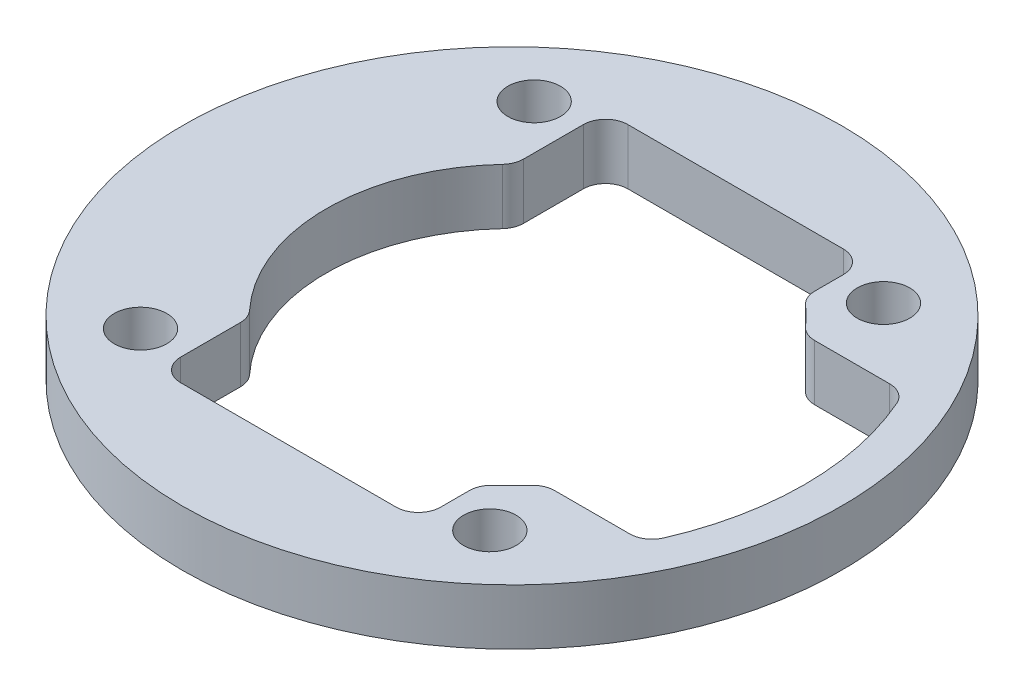
ISO-10303-21;
HEADER;
FILE_DESCRIPTION(('STEP AP214'),'2;1');
FILE_NAME('part.step','',(''),(''),'','','');
FILE_SCHEMA(('AUTOMOTIVE_DESIGN { 1 0 10303 214 1 1 1 1 }'));
ENDSEC;
DATA;
#1=APPLICATION_CONTEXT('core data for automotive mechanical design processes');
#2=APPLICATION_PROTOCOL_DEFINITION('international standard','automotive_design',2000,#1);
#3=PRODUCT_CONTEXT('',#1,'mechanical');
#4=PRODUCT('Part','Part','',(#3));
#5=PRODUCT_RELATED_PRODUCT_CATEGORY('part','',(#4));
#6=PRODUCT_DEFINITION_FORMATION('','',#4);
#7=PRODUCT_DEFINITION_CONTEXT('part definition',#1,'design');
#8=PRODUCT_DEFINITION('design','',#6,#7);
#9=PRODUCT_DEFINITION_SHAPE('','',#8);
#10=(LENGTH_UNIT() NAMED_UNIT(*) SI_UNIT(.MILLI.,.METRE.));
#11=(NAMED_UNIT(*) PLANE_ANGLE_UNIT() SI_UNIT($,.RADIAN.));
#12=(NAMED_UNIT(*) SI_UNIT($,.STERADIAN.) SOLID_ANGLE_UNIT());
#13=UNCERTAINTY_MEASURE_WITH_UNIT(LENGTH_MEASURE(1.E-05),#10,'distance_accuracy_value','');
#14=(GEOMETRIC_REPRESENTATION_CONTEXT(3) GLOBAL_UNCERTAINTY_ASSIGNED_CONTEXT((#13)) GLOBAL_UNIT_ASSIGNED_CONTEXT((#10,
#11,#12)) REPRESENTATION_CONTEXT('',''));
#15=CARTESIAN_POINT('',(0.,0.,0.));
#16=DIRECTION('',(0.,0.,1.));
#17=DIRECTION('',(1.,0.,0.));
#18=AXIS2_PLACEMENT_3D('',#15,#16,#17);
#19=CARTESIAN_POINT('',(0.,23.8125,0.));
#20=DIRECTION('',(0.,1.,0.));
#21=DIRECTION('',(0.,0.,1.));
#22=AXIS2_PLACEMENT_3D('',#19,#20,#21);
#23=PLANE('',#22);
#24=CARTESIAN_POINT('',(14.9331760640529,23.8125,-16.8275));
#25=DIRECTION('',(0.,1.,0.));
#26=DIRECTION('',(0.,0.,1.));
#27=AXIS2_PLACEMENT_3D('',#24,#25,#26);
#28=CIRCLE('',#27,2.2479);
#29=CARTESIAN_POINT('',(14.9331760640529,23.8125,-14.5796));
#30=VERTEX_POINT('',#29);
#31=EDGE_CURVE('E396',#30,#30,#28,.T.);
#32=ORIENTED_EDGE('',*,*,#31,.T.);
#33=EDGE_LOOP('',(#32));
#34=FACE_BOUND('',#33,.T.);
#35=CARTESIAN_POINT('',(14.9331760640529,23.8125,16.8275));
#36=DIRECTION('',(0.,1.,0.));
#37=DIRECTION('',(0.,0.,1.));
#38=AXIS2_PLACEMENT_3D('',#35,#36,#37);
#39=CIRCLE('',#38,2.2479);
#40=CARTESIAN_POINT('',(14.9331760640529,23.8125,19.0754));
#41=VERTEX_POINT('',#40);
#42=EDGE_CURVE('E392',#41,#41,#39,.T.);
#43=ORIENTED_EDGE('',*,*,#42,.T.);
#44=EDGE_LOOP('',(#43));
#45=FACE_BOUND('',#44,.T.);
#46=CARTESIAN_POINT('',(-14.9331760640529,23.8125,16.8275));
#47=DIRECTION('',(0.,1.,0.));
#48=DIRECTION('',(0.,0.,1.));
#49=AXIS2_PLACEMENT_3D('',#46,#47,#48);
#50=CIRCLE('',#49,2.2479);
#51=CARTESIAN_POINT('',(-14.9331760640529,23.8125,19.0754));
#52=VERTEX_POINT('',#51);
#53=EDGE_CURVE('E388',#52,#52,#50,.T.);
#54=ORIENTED_EDGE('',*,*,#53,.T.);
#55=EDGE_LOOP('',(#54));
#56=FACE_BOUND('',#55,.T.);
#57=CARTESIAN_POINT('',(-14.9331760640529,23.8125,-16.8275));
#58=DIRECTION('',(0.,1.,0.));
#59=DIRECTION('',(0.,0.,1.));
#60=AXIS2_PLACEMENT_3D('',#57,#58,#59);
#61=CIRCLE('',#60,2.2479);
#62=CARTESIAN_POINT('',(-14.9331760640529,23.8125,-14.5796));
#63=VERTEX_POINT('',#62);
#64=EDGE_CURVE('E383',#63,#63,#61,.T.);
#65=ORIENTED_EDGE('',*,*,#64,.T.);
#66=EDGE_LOOP('',(#65));
#67=FACE_BOUND('',#66,.T.);
#68=CARTESIAN_POINT('',(0.,23.8125,0.));
#69=DIRECTION('',(0.,1.,0.));
#70=DIRECTION('',(0.,0.,1.));
#71=AXIS2_PLACEMENT_3D('',#68,#69,#70);
#72=CIRCLE('',#71,28.175);
#73=CARTESIAN_POINT('',(0.,23.8125,28.175));
#74=VERTEX_POINT('',#73);
#75=EDGE_CURVE('E361',#74,#74,#72,.T.);
#76=ORIENTED_EDGE('',*,*,#75,.F.);
#77=EDGE_LOOP('',(#76));
#78=FACE_BOUND('',#77,.T.);
#79=DIRECTION('',(0.,0.,-1.));
#80=VECTOR('',#79,1.);
#81=CARTESIAN_POINT('',(11.1125,23.8125,0.));
#82=LINE('',#81,#80);
#83=CARTESIAN_POINT('',(11.1125,23.8125,17.2110313938328));
#84=VERTEX_POINT('',#83);
#85=CARTESIAN_POINT('',(11.1125,23.8125,14.7663102618765));
#86=VERTEX_POINT('',#85);
#87=EDGE_CURVE('E297',#84,#86,#82,.T.);
#88=ORIENTED_EDGE('',*,*,#87,.T.);
#89=CARTESIAN_POINT('',(13.0175,23.8125,14.7663102618765));
#90=DIRECTION('',(0.,1.,0.));
#91=DIRECTION('',(0.,0.,1.));
#92=AXIS2_PLACEMENT_3D('',#89,#90,#91);
#93=CIRCLE('',#92,1.905);
#94=CARTESIAN_POINT('',(11.7577419354839,23.8125,13.3373124945981));
#95=VERTEX_POINT('',#94);
#96=EDGE_CURVE('E215',#86,#95,#93,.F.);
#97=ORIENTED_EDGE('',*,*,#96,.T.);
#98=CARTESIAN_POINT('',(0.,23.8125,0.));
#99=DIRECTION('',(0.,1.,0.));
#100=DIRECTION('',(0.,0.,1.));
#101=AXIS2_PLACEMENT_3D('',#98,#99,#100);
#102=CIRCLE('',#101,17.78);
#103=CARTESIAN_POINT('',(13.3373124945981,23.8125,11.7577419354839));
#104=VERTEX_POINT('',#103);
#105=EDGE_CURVE('E201',#104,#95,#102,.F.);
#106=ORIENTED_EDGE('',*,*,#105,.F.);
#107=CARTESIAN_POINT('',(14.7663102618765,23.8125,13.0175));
#108=DIRECTION('',(0.,1.,0.));
#109=DIRECTION('',(0.,0.,1.));
#110=AXIS2_PLACEMENT_3D('',#107,#108,#109);
#111=CIRCLE('',#110,1.905);
#112=CARTESIAN_POINT('',(14.7663102618765,23.8125,11.1125));
#113=VERTEX_POINT('',#112);
#114=EDGE_CURVE('E212',#104,#113,#111,.F.);
#115=ORIENTED_EDGE('',*,*,#114,.T.);
#116=DIRECTION('',(1.,0.,0.));
#117=VECTOR('',#116,1.);
#118=CARTESIAN_POINT('',(11.3370176303118,23.8125,11.1125));
#119=LINE('',#118,#117);
#120=CARTESIAN_POINT('',(21.1802022830284,23.8125,11.1125));
#121=VERTEX_POINT('',#120);
#122=EDGE_CURVE('E357',#113,#121,#119,.T.);
#123=ORIENTED_EDGE('',*,*,#122,.T.);
#124=CARTESIAN_POINT('',(21.1802022830284,23.8125,9.2075));
#125=DIRECTION('',(0.,1.,0.));
#126=DIRECTION('',(0.,0.,1.));
#127=AXIS2_PLACEMENT_3D('',#124,#125,#126);
#128=CIRCLE('',#127,1.905);
#129=CARTESIAN_POINT('',(22.9272594533756,23.8125,9.96698419571335));
#130=VERTEX_POINT('',#129);
#131=EDGE_CURVE('E277',#121,#130,#128,.T.);
#132=ORIENTED_EDGE('',*,*,#131,.T.);
#133=CARTESIAN_POINT('',(0.,23.8125,0.));
#134=DIRECTION('',(0.,1.,0.));
#135=DIRECTION('',(0.,0.,1.));
#136=AXIS2_PLACEMENT_3D('',#133,#134,#135);
#137=CIRCLE('',#136,25.);
#138=CARTESIAN_POINT('',(22.9272594533756,23.8125,-9.96698419571336));
#139=VERTEX_POINT('',#138);
#140=EDGE_CURVE('E384',#130,#139,#137,.T.);
#141=ORIENTED_EDGE('',*,*,#140,.T.);
#142=CARTESIAN_POINT('',(21.1802022830284,23.8125,-9.2075));
#143=DIRECTION('',(0.,1.,0.));
#144=DIRECTION('',(0.,0.,1.));
#145=AXIS2_PLACEMENT_3D('',#142,#143,#144);
#146=CIRCLE('',#145,1.905);
#147=CARTESIAN_POINT('',(21.1802022830284,23.8125,-11.1125));
#148=VERTEX_POINT('',#147);
#149=EDGE_CURVE('E57',#139,#148,#146,.T.);
#150=ORIENTED_EDGE('',*,*,#149,.T.);
#151=DIRECTION('',(-1.,0.,0.));
#152=VECTOR('',#151,1.);
#153=CARTESIAN_POINT('',(22.225,23.8125,-11.1125));
#154=LINE('',#153,#152);
#155=CARTESIAN_POINT('',(14.7663102618765,23.8125,-11.1125));
#156=VERTEX_POINT('',#155);
#157=EDGE_CURVE('E358',#148,#156,#154,.T.);
#158=ORIENTED_EDGE('',*,*,#157,.T.);
#159=CARTESIAN_POINT('',(14.7663102618765,23.8125,-13.0175));
#160=DIRECTION('',(0.,1.,0.));
#161=DIRECTION('',(0.,0.,1.));
#162=AXIS2_PLACEMENT_3D('',#159,#160,#161);
#163=CIRCLE('',#162,1.905);
#164=CARTESIAN_POINT('',(13.3373124945981,23.8125,-11.7577419354839));
#165=VERTEX_POINT('',#164);
#166=EDGE_CURVE('E49',#156,#165,#163,.F.);
#167=ORIENTED_EDGE('',*,*,#166,.T.);
#168=CARTESIAN_POINT('',(11.7577419354839,23.8125,-13.3373124945981));
#169=VERTEX_POINT('',#168);
#170=EDGE_CURVE('E216',#169,#165,#102,.F.);
#171=ORIENTED_EDGE('',*,*,#170,.F.);
#172=CARTESIAN_POINT('',(13.0175,23.8125,-14.7663102618765));
#173=DIRECTION('',(0.,1.,0.));
#174=DIRECTION('',(0.,0.,1.));
#175=AXIS2_PLACEMENT_3D('',#172,#173,#174);
#176=CIRCLE('',#175,1.905);
#177=CARTESIAN_POINT('',(11.1125,23.8125,-14.7663102618765));
#178=VERTEX_POINT('',#177);
#179=EDGE_CURVE('E226',#169,#178,#176,.F.);
#180=ORIENTED_EDGE('',*,*,#179,.T.);
#181=CARTESIAN_POINT('',(11.1125,23.8125,-17.2110313938328));
#182=VERTEX_POINT('',#181);
#183=EDGE_CURVE('E311',#178,#182,#82,.T.);
#184=ORIENTED_EDGE('',*,*,#183,.T.);
#185=CARTESIAN_POINT('',(9.2075,23.8125,-17.2110313938328));
#186=DIRECTION('',(0.,1.,0.));
#187=DIRECTION('',(0.,0.,1.));
#188=AXIS2_PLACEMENT_3D('',#185,#186,#187);
#189=CIRCLE('',#188,1.905);
#190=CARTESIAN_POINT('',(9.2075,23.8125,-19.1160313938328));
#191=VERTEX_POINT('',#190);
#192=EDGE_CURVE('E284',#182,#191,#189,.T.);
#193=ORIENTED_EDGE('',*,*,#192,.T.);
#194=DIRECTION('',(-1.,0.,0.));
#195=VECTOR('',#194,1.);
#196=CARTESIAN_POINT('',(0.,23.8125,-19.1160313938328));
#197=LINE('',#196,#195);
#198=CARTESIAN_POINT('',(-9.2075,23.8125,-19.1160313938328));
#199=VERTEX_POINT('',#198);
#200=EDGE_CURVE('E337',#191,#199,#197,.T.);
#201=ORIENTED_EDGE('',*,*,#200,.T.);
#202=CARTESIAN_POINT('',(-9.2075,23.8125,-17.2110313938328));
#203=DIRECTION('',(0.,1.,0.));
#204=DIRECTION('',(0.,0.,1.));
#205=AXIS2_PLACEMENT_3D('',#202,#203,#204);
#206=CIRCLE('',#205,1.905);
#207=CARTESIAN_POINT('',(-11.1125,23.8125,-17.2110313938328));
#208=VERTEX_POINT('',#207);
#209=EDGE_CURVE('E288',#199,#208,#206,.T.);
#210=ORIENTED_EDGE('',*,*,#209,.T.);
#211=DIRECTION('',(0.,0.,-1.));
#212=VECTOR('',#211,1.);
#213=CARTESIAN_POINT('',(-11.1125,23.8125,0.));
#214=LINE('',#213,#212);
#215=CARTESIAN_POINT('',(-11.1125,23.8125,-12.110866762953));
#216=VERTEX_POINT('',#215);
#217=EDGE_CURVE('E310',#216,#208,#214,.T.);
#218=ORIENTED_EDGE('',*,*,#217,.F.);
#219=CARTESIAN_POINT('',(-13.0175,23.8125,-12.110866762953));
#220=DIRECTION('',(0.,1.,0.));
#221=DIRECTION('',(0.,0.,1.));
#222=AXIS2_PLACEMENT_3D('',#219,#220,#221);
#223=CIRCLE('',#222,1.905);
#224=CARTESIAN_POINT('',(-11.6227678571429,23.8125,-10.8132738954938));
#225=VERTEX_POINT('',#224);
#226=EDGE_CURVE('E323',#216,#225,#223,.F.);
#227=ORIENTED_EDGE('',*,*,#226,.T.);
#228=CARTESIAN_POINT('',(0.,23.8125,0.));
#229=DIRECTION('',(0.,1.,0.));
#230=DIRECTION('',(0.,0.,1.));
#231=AXIS2_PLACEMENT_3D('',#228,#229,#230);
#232=CIRCLE('',#231,15.875);
#233=CARTESIAN_POINT('',(-11.6227678571429,23.8125,10.8132738954938));
#234=VERTEX_POINT('',#233);
#235=EDGE_CURVE('E359',#225,#234,#232,.T.);
#236=ORIENTED_EDGE('',*,*,#235,.T.);
#237=CARTESIAN_POINT('',(-13.0175,23.8125,12.110866762953));
#238=DIRECTION('',(0.,1.,0.));
#239=DIRECTION('',(0.,0.,1.));
#240=AXIS2_PLACEMENT_3D('',#237,#238,#239);
#241=CIRCLE('',#240,1.905);
#242=CARTESIAN_POINT('',(-11.1125,23.8125,12.110866762953));
#243=VERTEX_POINT('',#242);
#244=EDGE_CURVE('E316',#234,#243,#241,.F.);
#245=ORIENTED_EDGE('',*,*,#244,.T.);
#246=CARTESIAN_POINT('',(-11.1125,23.8125,17.2110313938328));
#247=VERTEX_POINT('',#246);
#248=EDGE_CURVE('E416',#247,#243,#214,.T.);
#249=ORIENTED_EDGE('',*,*,#248,.F.);
#250=CARTESIAN_POINT('',(-9.2075,23.8125,17.2110313938328));
#251=DIRECTION('',(0.,1.,0.));
#252=DIRECTION('',(0.,0.,1.));
#253=AXIS2_PLACEMENT_3D('',#250,#251,#252);
#254=CIRCLE('',#253,1.905);
#255=CARTESIAN_POINT('',(-9.2075,23.8125,19.1160313938328));
#256=VERTEX_POINT('',#255);
#257=EDGE_CURVE('E292',#247,#256,#254,.T.);
#258=ORIENTED_EDGE('',*,*,#257,.T.);
#259=DIRECTION('',(1.,0.,0.));
#260=VECTOR('',#259,1.);
#261=CARTESIAN_POINT('',(0.,23.8125,19.1160313938328));
#262=LINE('',#261,#260);
#263=CARTESIAN_POINT('',(9.2075,23.8125,19.1160313938328));
#264=VERTEX_POINT('',#263);
#265=EDGE_CURVE('E299',#256,#264,#262,.T.);
#266=ORIENTED_EDGE('',*,*,#265,.T.);
#267=CARTESIAN_POINT('',(9.2075,23.8125,17.2110313938328));
#268=DIRECTION('',(0.,1.,0.));
#269=DIRECTION('',(0.,0.,1.));
#270=AXIS2_PLACEMENT_3D('',#267,#268,#269);
#271=CIRCLE('',#270,1.905);
#272=EDGE_CURVE('E42',#264,#84,#271,.T.);
#273=ORIENTED_EDGE('',*,*,#272,.T.);
#274=EDGE_LOOP('',(#88,#97,#106,#115,#123,#132,#141,#150,#158,#167,#171,#180,#184,#193,#201,
#210,#218,#227,#236,#245,#249,#258,#266,#273));
#275=FACE_BOUND('',#274,.T.);
#276=ADVANCED_FACE('F34',(#34,#45,#56,#67,#78,#275),#23,.F.);
#277=CARTESIAN_POINT('',(22.225,108.265934239724,-11.1125));
#278=DIRECTION('',(0.,0.,1.));
#279=DIRECTION('',(1.,0.,0.));
#280=AXIS2_PLACEMENT_3D('',#277,#278,#279);
#281=PLANE('',#280);
#282=DIRECTION('',(-1.,0.,0.));
#283=VECTOR('',#282,1.);
#284=CARTESIAN_POINT('',(22.225,28.575,-11.1125));
#285=LINE('',#284,#283);
#286=CARTESIAN_POINT('',(21.1802022830284,28.575,-11.1125));
#287=VERTEX_POINT('',#286);
#288=CARTESIAN_POINT('',(14.7663102618765,28.575,-11.1125));
#289=VERTEX_POINT('',#288);
#290=EDGE_CURVE('E370',#287,#289,#285,.T.);
#291=ORIENTED_EDGE('',*,*,#290,.T.);
#292=DIRECTION('',(0.,1.,0.));
#293=VECTOR('',#292,1.);
#294=CARTESIAN_POINT('',(14.7663102618765,108.265934239724,-11.1125));
#295=LINE('',#294,#293);
#296=EDGE_CURVE('E235',#289,#156,#295,.F.);
#297=ORIENTED_EDGE('',*,*,#296,.T.);
#298=ORIENTED_EDGE('',*,*,#157,.F.);
#299=DIRECTION('',(0.,-1.,0.));
#300=VECTOR('',#299,1.);
#301=CARTESIAN_POINT('',(21.1802022830284,108.265934239724,-11.1125));
#302=LINE('',#301,#300);
#303=EDGE_CURVE('E233',#148,#287,#302,.F.);
#304=ORIENTED_EDGE('',*,*,#303,.T.);
#305=EDGE_LOOP('',(#291,#297,#298,#304));
#306=FACE_BOUND('',#305,.T.);
#307=ADVANCED_FACE('F442',(#306),#281,.T.);
#308=CARTESIAN_POINT('',(11.3370176303118,108.265934239724,11.1125));
#309=DIRECTION('',(0.,0.,-1.));
#310=DIRECTION('',(-1.,0.,0.));
#311=AXIS2_PLACEMENT_3D('',#308,#309,#310);
#312=PLANE('',#311);
#313=ORIENTED_EDGE('',*,*,#122,.F.);
#314=DIRECTION('',(0.,1.,0.));
#315=VECTOR('',#314,1.);
#316=CARTESIAN_POINT('',(14.7663102618765,108.265934239724,11.1125));
#317=LINE('',#316,#315);
#318=CARTESIAN_POINT('',(14.7663102618765,28.575,11.1125));
#319=VERTEX_POINT('',#318);
#320=EDGE_CURVE('E222',#113,#319,#317,.T.);
#321=ORIENTED_EDGE('',*,*,#320,.T.);
#322=DIRECTION('',(1.,0.,0.));
#323=VECTOR('',#322,1.);
#324=CARTESIAN_POINT('',(11.3370176303118,28.575,11.1125));
#325=LINE('',#324,#323);
#326=CARTESIAN_POINT('',(21.1802022830284,28.575,11.1125));
#327=VERTEX_POINT('',#326);
#328=EDGE_CURVE('E353',#319,#327,#325,.T.);
#329=ORIENTED_EDGE('',*,*,#328,.T.);
#330=DIRECTION('',(0.,-1.,0.));
#331=VECTOR('',#330,1.);
#332=CARTESIAN_POINT('',(21.1802022830284,108.265934239724,11.1125));
#333=LINE('',#332,#331);
#334=EDGE_CURVE('E224',#327,#121,#333,.T.);
#335=ORIENTED_EDGE('',*,*,#334,.T.);
#336=EDGE_LOOP('',(#313,#321,#329,#335));
#337=FACE_BOUND('',#336,.T.);
#338=ADVANCED_FACE('F355',(#337),#312,.T.);
#339=CARTESIAN_POINT('',(0.,28.575,0.));
#340=DIRECTION('',(0.,1.,0.));
#341=DIRECTION('',(0.,0.,1.));
#342=AXIS2_PLACEMENT_3D('',#339,#340,#341);
#343=PLANE('',#342);
#344=CARTESIAN_POINT('',(14.9331760640529,28.575,-16.8275));
#345=DIRECTION('',(0.,1.,0.));
#346=DIRECTION('',(0.,0.,1.));
#347=AXIS2_PLACEMENT_3D('',#344,#345,#346);
#348=CIRCLE('',#347,2.2479);
#349=CARTESIAN_POINT('',(14.9331760640529,28.575,-14.5796));
#350=VERTEX_POINT('',#349);
#351=EDGE_CURVE('E393',#350,#350,#348,.T.);
#352=ORIENTED_EDGE('',*,*,#351,.F.);
#353=EDGE_LOOP('',(#352));
#354=FACE_BOUND('',#353,.T.);
#355=CARTESIAN_POINT('',(14.9331760640529,28.575,16.8275));
#356=DIRECTION('',(0.,1.,0.));
#357=DIRECTION('',(0.,0.,1.));
#358=AXIS2_PLACEMENT_3D('',#355,#356,#357);
#359=CIRCLE('',#358,2.2479);
#360=CARTESIAN_POINT('',(14.9331760640529,28.575,19.0754));
#361=VERTEX_POINT('',#360);
#362=EDGE_CURVE('E389',#361,#361,#359,.T.);
#363=ORIENTED_EDGE('',*,*,#362,.F.);
#364=EDGE_LOOP('',(#363));
#365=FACE_BOUND('',#364,.T.);
#366=CARTESIAN_POINT('',(-14.9331760640529,28.575,16.8275));
#367=DIRECTION('',(0.,1.,0.));
#368=DIRECTION('',(0.,0.,1.));
#369=AXIS2_PLACEMENT_3D('',#366,#367,#368);
#370=CIRCLE('',#369,2.2479);
#371=CARTESIAN_POINT('',(-14.9331760640529,28.575,19.0754));
#372=VERTEX_POINT('',#371);
#373=EDGE_CURVE('E385',#372,#372,#370,.T.);
#374=ORIENTED_EDGE('',*,*,#373,.F.);
#375=EDGE_LOOP('',(#374));
#376=FACE_BOUND('',#375,.T.);
#377=CARTESIAN_POINT('',(-14.9331760640529,28.575,-16.8275));
#378=DIRECTION('',(0.,1.,0.));
#379=DIRECTION('',(0.,0.,1.));
#380=AXIS2_PLACEMENT_3D('',#377,#378,#379);
#381=CIRCLE('',#380,2.2479);
#382=CARTESIAN_POINT('',(-14.9331760640529,28.575,-14.5796));
#383=VERTEX_POINT('',#382);
#384=EDGE_CURVE('E380',#383,#383,#381,.T.);
#385=ORIENTED_EDGE('',*,*,#384,.F.);
#386=EDGE_LOOP('',(#385));
#387=FACE_BOUND('',#386,.T.);
#388=CARTESIAN_POINT('',(0.,28.575,0.));
#389=DIRECTION('',(0.,1.,0.));
#390=DIRECTION('',(0.,0.,1.));
#391=AXIS2_PLACEMENT_3D('',#388,#389,#390);
#392=CIRCLE('',#391,28.175);
#393=CARTESIAN_POINT('',(0.,28.575,28.175));
#394=VERTEX_POINT('',#393);
#395=EDGE_CURVE('E373',#394,#394,#392,.T.);
#396=ORIENTED_EDGE('',*,*,#395,.T.);
#397=EDGE_LOOP('',(#396));
#398=FACE_BOUND('',#397,.T.);
#399=CARTESIAN_POINT('',(0.,28.575,0.));
#400=DIRECTION('',(0.,-1.,0.));
#401=DIRECTION('',(0.,0.,1.));
#402=AXIS2_PLACEMENT_3D('',#399,#400,#401);
#403=CIRCLE('',#402,17.78);
#404=CARTESIAN_POINT('',(13.3373124945981,28.575,11.7577419354839));
#405=VERTEX_POINT('',#404);
#406=CARTESIAN_POINT('',(11.7577419354839,28.575,13.3373124945981));
#407=VERTEX_POINT('',#406);
#408=EDGE_CURVE('E204',#405,#407,#403,.T.);
#409=ORIENTED_EDGE('',*,*,#408,.T.);
#410=CARTESIAN_POINT('',(13.0175,28.575,14.7663102618765));
#411=DIRECTION('',(0.,1.,0.));
#412=DIRECTION('',(0.,0.,1.));
#413=AXIS2_PLACEMENT_3D('',#410,#411,#412);
#414=CIRCLE('',#413,1.905);
#415=CARTESIAN_POINT('',(11.1125,28.575,14.7663102618765));
#416=VERTEX_POINT('',#415);
#417=EDGE_CURVE('E314',#407,#416,#414,.T.);
#418=ORIENTED_EDGE('',*,*,#417,.T.);
#419=DIRECTION('',(0.,0.,-1.));
#420=VECTOR('',#419,1.);
#421=CARTESIAN_POINT('',(11.1125,28.575,0.));
#422=LINE('',#421,#420);
#423=CARTESIAN_POINT('',(11.1125,28.575,17.2110313938328));
#424=VERTEX_POINT('',#423);
#425=EDGE_CURVE('E525',#424,#416,#422,.T.);
#426=ORIENTED_EDGE('',*,*,#425,.F.);
#427=CARTESIAN_POINT('',(9.2075,28.575,17.2110313938328));
#428=DIRECTION('',(0.,1.,0.));
#429=DIRECTION('',(0.,0.,1.));
#430=AXIS2_PLACEMENT_3D('',#427,#428,#429);
#431=CIRCLE('',#430,1.905);
#432=CARTESIAN_POINT('',(9.2075,28.575,19.1160313938328));
#433=VERTEX_POINT('',#432);
#434=EDGE_CURVE('E11',#424,#433,#431,.F.);
#435=ORIENTED_EDGE('',*,*,#434,.T.);
#436=DIRECTION('',(1.,0.,0.));
#437=VECTOR('',#436,1.);
#438=CARTESIAN_POINT('',(0.,28.575,19.1160313938328));
#439=LINE('',#438,#437);
#440=CARTESIAN_POINT('',(-9.2075,28.575,19.1160313938328));
#441=VERTEX_POINT('',#440);
#442=EDGE_CURVE('E374',#441,#433,#439,.T.);
#443=ORIENTED_EDGE('',*,*,#442,.F.);
#444=CARTESIAN_POINT('',(-9.2075,28.575,17.2110313938328));
#445=DIRECTION('',(0.,1.,0.));
#446=DIRECTION('',(0.,0.,1.));
#447=AXIS2_PLACEMENT_3D('',#444,#445,#446);
#448=CIRCLE('',#447,1.905);
#449=CARTESIAN_POINT('',(-11.1125,28.575,17.2110313938328));
#450=VERTEX_POINT('',#449);
#451=EDGE_CURVE('E294',#441,#450,#448,.F.);
#452=ORIENTED_EDGE('',*,*,#451,.T.);
#453=DIRECTION('',(0.,0.,1.));
#454=VECTOR('',#453,1.);
#455=CARTESIAN_POINT('',(-11.1125,28.575,0.));
#456=LINE('',#455,#454);
#457=CARTESIAN_POINT('',(-11.1125,28.575,12.110866762953));
#458=VERTEX_POINT('',#457);
#459=EDGE_CURVE('E404',#458,#450,#456,.T.);
#460=ORIENTED_EDGE('',*,*,#459,.F.);
#461=CARTESIAN_POINT('',(-13.0175,28.575,12.110866762953));
#462=DIRECTION('',(0.,1.,0.));
#463=DIRECTION('',(0.,0.,1.));
#464=AXIS2_PLACEMENT_3D('',#461,#462,#463);
#465=CIRCLE('',#464,1.905);
#466=CARTESIAN_POINT('',(-11.6227678571429,28.575,10.8132738954938));
#467=VERTEX_POINT('',#466);
#468=EDGE_CURVE('E347',#458,#467,#465,.T.);
#469=ORIENTED_EDGE('',*,*,#468,.T.);
#470=CARTESIAN_POINT('',(0.,28.575,0.));
#471=DIRECTION('',(0.,1.,0.));
#472=DIRECTION('',(0.,0.,1.));
#473=AXIS2_PLACEMENT_3D('',#470,#471,#472);
#474=CIRCLE('',#473,15.875);
#475=CARTESIAN_POINT('',(-11.6227678571429,28.575,-10.8132738954938));
#476=VERTEX_POINT('',#475);
#477=EDGE_CURVE('E364',#476,#467,#474,.T.);
#478=ORIENTED_EDGE('',*,*,#477,.F.);
#479=CARTESIAN_POINT('',(-13.0175,28.575,-12.110866762953));
#480=DIRECTION('',(0.,1.,0.));
#481=DIRECTION('',(0.,0.,1.));
#482=AXIS2_PLACEMENT_3D('',#479,#480,#481);
#483=CIRCLE('',#482,1.905);
#484=CARTESIAN_POINT('',(-11.1125,28.575,-12.110866762953));
#485=VERTEX_POINT('',#484);
#486=EDGE_CURVE('E344',#476,#485,#483,.T.);
#487=ORIENTED_EDGE('',*,*,#486,.T.);
#488=CARTESIAN_POINT('',(-11.1125,28.575,-17.2110313938328));
#489=VERTEX_POINT('',#488);
#490=EDGE_CURVE('E521',#489,#485,#456,.T.);
#491=ORIENTED_EDGE('',*,*,#490,.F.);
#492=CARTESIAN_POINT('',(-9.2075,28.575,-17.2110313938328));
#493=DIRECTION('',(0.,1.,0.));
#494=DIRECTION('',(0.,0.,1.));
#495=AXIS2_PLACEMENT_3D('',#492,#493,#494);
#496=CIRCLE('',#495,1.905);
#497=CARTESIAN_POINT('',(-9.2075,28.575,-19.1160313938328));
#498=VERTEX_POINT('',#497);
#499=EDGE_CURVE('E290',#489,#498,#496,.F.);
#500=ORIENTED_EDGE('',*,*,#499,.T.);
#501=DIRECTION('',(-1.,0.,0.));
#502=VECTOR('',#501,1.);
#503=CARTESIAN_POINT('',(0.,28.575,-19.1160313938328));
#504=LINE('',#503,#502);
#505=CARTESIAN_POINT('',(9.2075,28.575,-19.1160313938328));
#506=VERTEX_POINT('',#505);
#507=EDGE_CURVE('E377',#506,#498,#504,.T.);
#508=ORIENTED_EDGE('',*,*,#507,.F.);
#509=CARTESIAN_POINT('',(9.2075,28.575,-17.2110313938328));
#510=DIRECTION('',(0.,1.,0.));
#511=DIRECTION('',(0.,0.,1.));
#512=AXIS2_PLACEMENT_3D('',#509,#510,#511);
#513=CIRCLE('',#512,1.905);
#514=CARTESIAN_POINT('',(11.1125,28.575,-17.2110313938328));
#515=VERTEX_POINT('',#514);
#516=EDGE_CURVE('E286',#506,#515,#513,.F.);
#517=ORIENTED_EDGE('',*,*,#516,.T.);
#518=CARTESIAN_POINT('',(11.1125,28.575,-14.7663102618765));
#519=VERTEX_POINT('',#518);
#520=EDGE_CURVE('E524',#519,#515,#422,.T.);
#521=ORIENTED_EDGE('',*,*,#520,.F.);
#522=CARTESIAN_POINT('',(13.0175,28.575,-14.7663102618765));
#523=DIRECTION('',(0.,1.,0.));
#524=DIRECTION('',(0.,0.,1.));
#525=AXIS2_PLACEMENT_3D('',#522,#523,#524);
#526=CIRCLE('',#525,1.905);
#527=CARTESIAN_POINT('',(11.7577419354839,28.575,-13.3373124945981));
#528=VERTEX_POINT('',#527);
#529=EDGE_CURVE('E339',#519,#528,#526,.T.);
#530=ORIENTED_EDGE('',*,*,#529,.T.);
#531=CARTESIAN_POINT('',(13.3373124945981,28.575,-11.7577419354839));
#532=VERTEX_POINT('',#531);
#533=EDGE_CURVE('E217',#528,#532,#403,.T.);
#534=ORIENTED_EDGE('',*,*,#533,.T.);
#535=CARTESIAN_POINT('',(14.7663102618765,28.575,-13.0175));
#536=DIRECTION('',(0.,1.,0.));
#537=DIRECTION('',(0.,0.,1.));
#538=AXIS2_PLACEMENT_3D('',#535,#536,#537);
#539=CIRCLE('',#538,1.905);
#540=EDGE_CURVE('E343',#532,#289,#539,.T.);
#541=ORIENTED_EDGE('',*,*,#540,.T.);
#542=ORIENTED_EDGE('',*,*,#290,.F.);
#543=CARTESIAN_POINT('',(21.1802022830284,28.575,-9.2075));
#544=DIRECTION('',(0.,1.,0.));
#545=DIRECTION('',(0.,0.,1.));
#546=AXIS2_PLACEMENT_3D('',#543,#544,#545);
#547=CIRCLE('',#546,1.905);
#548=CARTESIAN_POINT('',(22.9272594533756,28.575,-9.96698419571336));
#549=VERTEX_POINT('',#548);
#550=EDGE_CURVE('E282',#287,#549,#547,.F.);
#551=ORIENTED_EDGE('',*,*,#550,.T.);
#552=CARTESIAN_POINT('',(0.,28.575,0.));
#553=DIRECTION('',(0.,1.,0.));
#554=DIRECTION('',(0.,0.,1.));
#555=AXIS2_PLACEMENT_3D('',#552,#553,#554);
#556=CIRCLE('',#555,25.);
#557=CARTESIAN_POINT('',(22.9272594533756,28.575,9.96698419571335));
#558=VERTEX_POINT('',#557);
#559=EDGE_CURVE('E208',#558,#549,#556,.T.);
#560=ORIENTED_EDGE('',*,*,#559,.F.);
#561=CARTESIAN_POINT('',(21.1802022830284,28.575,9.2075));
#562=DIRECTION('',(0.,1.,0.));
#563=DIRECTION('',(0.,0.,1.));
#564=AXIS2_PLACEMENT_3D('',#561,#562,#563);
#565=CIRCLE('',#564,1.905);
#566=EDGE_CURVE('E279',#558,#327,#565,.F.);
#567=ORIENTED_EDGE('',*,*,#566,.T.);
#568=ORIENTED_EDGE('',*,*,#328,.F.);
#569=CARTESIAN_POINT('',(14.7663102618765,28.575,13.0175));
#570=DIRECTION('',(0.,1.,0.));
#571=DIRECTION('',(0.,0.,1.));
#572=AXIS2_PLACEMENT_3D('',#569,#570,#571);
#573=CIRCLE('',#572,1.905);
#574=EDGE_CURVE('E318',#319,#405,#573,.T.);
#575=ORIENTED_EDGE('',*,*,#574,.T.);
#576=EDGE_LOOP('',(#409,#418,#426,#435,#443,#452,#460,#469,#478,#487,#491,#500,#508,#517,#521,
#530,#534,#541,#542,#551,#560,#567,#568,#575));
#577=FACE_BOUND('',#576,.T.);
#578=ADVANCED_FACE('F351',(#354,#365,#376,#387,#398,#577),#343,.T.);
#579=CARTESIAN_POINT('',(11.1125,0.,0.));
#580=DIRECTION('',(1.,0.,0.));
#581=DIRECTION('',(0.,0.,-1.));
#582=AXIS2_PLACEMENT_3D('',#579,#580,#581);
#583=PLANE('',#582);
#584=ORIENTED_EDGE('',*,*,#183,.F.);
#585=DIRECTION('',(0.,-1.,0.));
#586=VECTOR('',#585,1.);
#587=CARTESIAN_POINT('',(11.1125,28.575,-14.7663102618765));
#588=LINE('',#587,#586);
#589=EDGE_CURVE('E244',#178,#519,#588,.F.);
#590=ORIENTED_EDGE('',*,*,#589,.T.);
#591=ORIENTED_EDGE('',*,*,#520,.T.);
#592=DIRECTION('',(0.,-1.,0.));
#593=VECTOR('',#592,1.);
#594=CARTESIAN_POINT('',(11.1125,23.8125,-17.2110313938328));
#595=LINE('',#594,#593);
#596=EDGE_CURVE('E241',#515,#182,#595,.T.);
#597=ORIENTED_EDGE('',*,*,#596,.T.);
#598=EDGE_LOOP('',(#584,#590,#591,#597));
#599=FACE_BOUND('',#598,.T.);
#600=ADVANCED_FACE('F333',(#599),#583,.F.);
#601=ORIENTED_EDGE('',*,*,#425,.T.);
#602=DIRECTION('',(0.,-1.,0.));
#603=VECTOR('',#602,1.);
#604=CARTESIAN_POINT('',(11.1125,23.8125,14.7663102618765));
#605=LINE('',#604,#603);
#606=EDGE_CURVE('E309',#416,#86,#605,.T.);
#607=ORIENTED_EDGE('',*,*,#606,.T.);
#608=ORIENTED_EDGE('',*,*,#87,.F.);
#609=DIRECTION('',(0.,-1.,0.));
#610=VECTOR('',#609,1.);
#611=CARTESIAN_POINT('',(11.1125,28.575,17.2110313938328));
#612=LINE('',#611,#610);
#613=EDGE_CURVE('E306',#84,#424,#612,.F.);
#614=ORIENTED_EDGE('',*,*,#613,.T.);
#615=EDGE_LOOP('',(#601,#607,#608,#614));
#616=FACE_BOUND('',#615,.T.);
#617=ADVANCED_FACE('F305',(#616),#583,.F.);
#618=CARTESIAN_POINT('',(0.,108.265934239724,0.));
#619=DIRECTION('',(0.,-1.,0.));
#620=DIRECTION('',(0.,0.,-1.));
#621=AXIS2_PLACEMENT_3D('',#618,#619,#620);
#622=CYLINDRICAL_SURFACE('',#621,28.175);
#623=ORIENTED_EDGE('',*,*,#75,.T.);
#624=EDGE_LOOP('',(#623));
#625=FACE_BOUND('',#624,.T.);
#626=ORIENTED_EDGE('',*,*,#395,.F.);
#627=EDGE_LOOP('',(#626));
#628=FACE_BOUND('',#627,.T.);
#629=ADVANCED_FACE('F428',(#625,#628),#622,.T.);
#630=CARTESIAN_POINT('',(0.,108.265934239724,0.));
#631=DIRECTION('',(0.,-1.,0.));
#632=DIRECTION('',(0.,0.,-1.));
#633=AXIS2_PLACEMENT_3D('',#630,#631,#632);
#634=CYLINDRICAL_SURFACE('',#633,15.875);
#635=ORIENTED_EDGE('',*,*,#235,.F.);
#636=DIRECTION('',(0.,-1.,0.));
#637=VECTOR('',#636,1.);
#638=CARTESIAN_POINT('',(-11.6227678571429,108.265934239724,-10.8132738954938));
#639=LINE('',#638,#637);
#640=EDGE_CURVE('E264',#225,#476,#639,.F.);
#641=ORIENTED_EDGE('',*,*,#640,.T.);
#642=ORIENTED_EDGE('',*,*,#477,.T.);
#643=DIRECTION('',(0.,-1.,0.));
#644=VECTOR('',#643,1.);
#645=CARTESIAN_POINT('',(-11.6227678571429,108.265934239724,10.8132738954938));
#646=LINE('',#645,#644);
#647=EDGE_CURVE('E261',#467,#234,#646,.T.);
#648=ORIENTED_EDGE('',*,*,#647,.T.);
#649=EDGE_LOOP('',(#635,#641,#642,#648));
#650=FACE_BOUND('',#649,.T.);
#651=ADVANCED_FACE('F410',(#650),#634,.F.);
#652=CARTESIAN_POINT('',(-11.1125,0.,0.));
#653=DIRECTION('',(1.,0.,0.));
#654=DIRECTION('',(0.,0.,-1.));
#655=AXIS2_PLACEMENT_3D('',#652,#653,#654);
#656=PLANE('',#655);
#657=ORIENTED_EDGE('',*,*,#217,.T.);
#658=DIRECTION('',(0.,-1.,0.));
#659=VECTOR('',#658,1.);
#660=CARTESIAN_POINT('',(-11.1125,0.,-17.2110313938328));
#661=LINE('',#660,#659);
#662=EDGE_CURVE('E259',#208,#489,#661,.F.);
#663=ORIENTED_EDGE('',*,*,#662,.T.);
#664=ORIENTED_EDGE('',*,*,#490,.T.);
#665=DIRECTION('',(0.,-1.,0.));
#666=VECTOR('',#665,1.);
#667=CARTESIAN_POINT('',(-11.1125,0.,-12.110866762953));
#668=LINE('',#667,#666);
#669=EDGE_CURVE('E257',#485,#216,#668,.T.);
#670=ORIENTED_EDGE('',*,*,#669,.T.);
#671=EDGE_LOOP('',(#657,#663,#664,#670));
#672=FACE_BOUND('',#671,.T.);
#673=ADVANCED_FACE('F436',(#672),#656,.T.);
#674=ORIENTED_EDGE('',*,*,#248,.T.);
#675=DIRECTION('',(0.,-1.,0.));
#676=VECTOR('',#675,1.);
#677=CARTESIAN_POINT('',(-11.1125,0.,12.110866762953));
#678=LINE('',#677,#676);
#679=EDGE_CURVE('E270',#243,#458,#678,.F.);
#680=ORIENTED_EDGE('',*,*,#679,.T.);
#681=ORIENTED_EDGE('',*,*,#459,.T.);
#682=DIRECTION('',(0.,-1.,0.));
#683=VECTOR('',#682,1.);
#684=CARTESIAN_POINT('',(-11.1125,0.,17.2110313938328));
#685=LINE('',#684,#683);
#686=EDGE_CURVE('E267',#450,#247,#685,.T.);
#687=ORIENTED_EDGE('',*,*,#686,.T.);
#688=EDGE_LOOP('',(#674,#680,#681,#687));
#689=FACE_BOUND('',#688,.T.);
#690=ADVANCED_FACE('F418',(#689),#656,.T.);
#691=CARTESIAN_POINT('',(-11.1125,66.675,19.1160313938328));
#692=DIRECTION('',(0.,0.,1.));
#693=DIRECTION('',(1.,0.,0.));
#694=AXIS2_PLACEMENT_3D('',#691,#692,#693);
#695=PLANE('',#694);
#696=ORIENTED_EDGE('',*,*,#265,.F.);
#697=DIRECTION('',(0.,-1.,0.));
#698=VECTOR('',#697,1.);
#699=CARTESIAN_POINT('',(-9.2075,66.675,19.1160313938328));
#700=LINE('',#699,#698);
#701=EDGE_CURVE('E275',#256,#441,#700,.F.);
#702=ORIENTED_EDGE('',*,*,#701,.T.);
#703=ORIENTED_EDGE('',*,*,#442,.T.);
#704=DIRECTION('',(0.,-1.,0.));
#705=VECTOR('',#704,1.);
#706=CARTESIAN_POINT('',(9.2075,23.8125,19.1160313938328));
#707=LINE('',#706,#705);
#708=EDGE_CURVE('E272',#433,#264,#707,.T.);
#709=ORIENTED_EDGE('',*,*,#708,.T.);
#710=EDGE_LOOP('',(#696,#702,#703,#709));
#711=FACE_BOUND('',#710,.T.);
#712=ADVANCED_FACE('F460',(#711),#695,.F.);
#713=CARTESIAN_POINT('',(-11.1125,66.675,-19.1160313938328));
#714=DIRECTION('',(0.,0.,-1.));
#715=DIRECTION('',(-1.,0.,0.));
#716=AXIS2_PLACEMENT_3D('',#713,#714,#715);
#717=PLANE('',#716);
#718=ORIENTED_EDGE('',*,*,#200,.F.);
#719=DIRECTION('',(0.,-1.,0.));
#720=VECTOR('',#719,1.);
#721=CARTESIAN_POINT('',(9.2075,28.575,-19.1160313938328));
#722=LINE('',#721,#720);
#723=EDGE_CURVE('E255',#191,#506,#722,.F.);
#724=ORIENTED_EDGE('',*,*,#723,.T.);
#725=ORIENTED_EDGE('',*,*,#507,.T.);
#726=DIRECTION('',(0.,-1.,0.));
#727=VECTOR('',#726,1.);
#728=CARTESIAN_POINT('',(-9.2075,66.675,-19.1160313938328));
#729=LINE('',#728,#727);
#730=EDGE_CURVE('E252',#498,#199,#729,.T.);
#731=ORIENTED_EDGE('',*,*,#730,.T.);
#732=EDGE_LOOP('',(#718,#724,#725,#731));
#733=FACE_BOUND('',#732,.T.);
#734=ADVANCED_FACE('F463',(#733),#717,.F.);
#735=CARTESIAN_POINT('',(-14.9331760640529,66.675,-16.8275));
#736=DIRECTION('',(0.,-1.,0.));
#737=DIRECTION('',(0.,0.,-1.));
#738=AXIS2_PLACEMENT_3D('',#735,#736,#737);
#739=CYLINDRICAL_SURFACE('',#738,2.2479);
#740=ORIENTED_EDGE('',*,*,#384,.T.);
#741=EDGE_LOOP('',(#740));
#742=FACE_BOUND('',#741,.T.);
#743=ORIENTED_EDGE('',*,*,#64,.F.);
#744=EDGE_LOOP('',(#743));
#745=FACE_BOUND('',#744,.T.);
#746=ADVANCED_FACE('F467',(#742,#745),#739,.F.);
#747=CARTESIAN_POINT('',(-14.9331760640529,66.675,16.8275));
#748=DIRECTION('',(0.,-1.,0.));
#749=DIRECTION('',(0.,0.,-1.));
#750=AXIS2_PLACEMENT_3D('',#747,#748,#749);
#751=CYLINDRICAL_SURFACE('',#750,2.2479);
#752=ORIENTED_EDGE('',*,*,#373,.T.);
#753=EDGE_LOOP('',(#752));
#754=FACE_BOUND('',#753,.T.);
#755=ORIENTED_EDGE('',*,*,#53,.F.);
#756=EDGE_LOOP('',(#755));
#757=FACE_BOUND('',#756,.T.);
#758=ADVANCED_FACE('F471',(#754,#757),#751,.F.);
#759=CARTESIAN_POINT('',(14.9331760640529,66.675,16.8275));
#760=DIRECTION('',(0.,-1.,0.));
#761=DIRECTION('',(0.,0.,-1.));
#762=AXIS2_PLACEMENT_3D('',#759,#760,#761);
#763=CYLINDRICAL_SURFACE('',#762,2.2479);
#764=ORIENTED_EDGE('',*,*,#362,.T.);
#765=EDGE_LOOP('',(#764));
#766=FACE_BOUND('',#765,.T.);
#767=ORIENTED_EDGE('',*,*,#42,.F.);
#768=EDGE_LOOP('',(#767));
#769=FACE_BOUND('',#768,.T.);
#770=ADVANCED_FACE('F475',(#766,#769),#763,.F.);
#771=CARTESIAN_POINT('',(14.9331760640529,66.675,-16.8275));
#772=DIRECTION('',(0.,-1.,0.));
#773=DIRECTION('',(0.,0.,-1.));
#774=AXIS2_PLACEMENT_3D('',#771,#772,#773);
#775=CYLINDRICAL_SURFACE('',#774,2.2479);
#776=ORIENTED_EDGE('',*,*,#351,.T.);
#777=EDGE_LOOP('',(#776));
#778=FACE_BOUND('',#777,.T.);
#779=ORIENTED_EDGE('',*,*,#31,.F.);
#780=EDGE_LOOP('',(#779));
#781=FACE_BOUND('',#780,.T.);
#782=ADVANCED_FACE('F479',(#778,#781),#775,.F.);
#783=CARTESIAN_POINT('',(0.,56.85282,0.));
#784=DIRECTION('',(0.,-1.,0.));
#785=DIRECTION('',(0.,0.,-1.));
#786=AXIS2_PLACEMENT_3D('',#783,#784,#785);
#787=CYLINDRICAL_SURFACE('',#786,25.);
#788=ORIENTED_EDGE('',*,*,#140,.F.);
#789=DIRECTION('',(0.,-1.,0.));
#790=VECTOR('',#789,1.);
#791=CARTESIAN_POINT('',(22.9272594533756,56.85282,9.96698419571336));
#792=LINE('',#791,#790);
#793=EDGE_CURVE('E250',#130,#558,#792,.F.);
#794=ORIENTED_EDGE('',*,*,#793,.T.);
#795=ORIENTED_EDGE('',*,*,#559,.T.);
#796=DIRECTION('',(0.,-1.,0.));
#797=VECTOR('',#796,1.);
#798=CARTESIAN_POINT('',(22.9272594533756,56.85282,-9.96698419571336));
#799=LINE('',#798,#797);
#800=EDGE_CURVE('E247',#549,#139,#799,.T.);
#801=ORIENTED_EDGE('',*,*,#800,.T.);
#802=EDGE_LOOP('',(#788,#794,#795,#801));
#803=FACE_BOUND('',#802,.T.);
#804=ADVANCED_FACE('F483',(#803),#787,.F.);
#805=CARTESIAN_POINT('',(0.,-11.1125,0.));
#806=DIRECTION('',(0.,1.,0.));
#807=DIRECTION('',(0.,0.,1.));
#808=AXIS2_PLACEMENT_3D('',#805,#806,#807);
#809=CYLINDRICAL_SURFACE('',#808,17.78);
#810=ORIENTED_EDGE('',*,*,#105,.T.);
#811=DIRECTION('',(0.,1.,0.));
#812=VECTOR('',#811,1.);
#813=CARTESIAN_POINT('',(11.7577419354839,-11.1125,13.3373124945982));
#814=LINE('',#813,#812);
#815=EDGE_CURVE('E207',#95,#407,#814,.T.);
#816=ORIENTED_EDGE('',*,*,#815,.T.);
#817=ORIENTED_EDGE('',*,*,#408,.F.);
#818=DIRECTION('',(0.,1.,0.));
#819=VECTOR('',#818,1.);
#820=CARTESIAN_POINT('',(13.3373124945982,-11.1125,11.7577419354839));
#821=LINE('',#820,#819);
#822=EDGE_CURVE('E197',#405,#104,#821,.F.);
#823=ORIENTED_EDGE('',*,*,#822,.T.);
#824=EDGE_LOOP('',(#810,#816,#817,#823));
#825=FACE_BOUND('',#824,.T.);
#826=ADVANCED_FACE('F199',(#825),#809,.F.);
#827=ORIENTED_EDGE('',*,*,#170,.T.);
#828=DIRECTION('',(0.,1.,0.));
#829=VECTOR('',#828,1.);
#830=CARTESIAN_POINT('',(13.3373124945981,-11.1125,-11.7577419354839));
#831=LINE('',#830,#829);
#832=EDGE_CURVE('E239',#165,#532,#831,.T.);
#833=ORIENTED_EDGE('',*,*,#832,.T.);
#834=ORIENTED_EDGE('',*,*,#533,.F.);
#835=DIRECTION('',(0.,1.,0.));
#836=VECTOR('',#835,1.);
#837=CARTESIAN_POINT('',(11.7577419354839,-11.1125,-13.3373124945982));
#838=LINE('',#837,#836);
#839=EDGE_CURVE('E237',#528,#169,#838,.F.);
#840=ORIENTED_EDGE('',*,*,#839,.T.);
#841=EDGE_LOOP('',(#827,#833,#834,#840));
#842=FACE_BOUND('',#841,.T.);
#843=ADVANCED_FACE('F488',(#842),#809,.F.);
#844=CARTESIAN_POINT('',(13.0175,-11.1125,14.7663102618765));
#845=DIRECTION('',(0.,1.,0.));
#846=DIRECTION('',(0.,0.,1.));
#847=AXIS2_PLACEMENT_3D('',#844,#845,#846);
#848=CYLINDRICAL_SURFACE('',#847,1.905);
#849=ORIENTED_EDGE('',*,*,#96,.F.);
#850=ORIENTED_EDGE('',*,*,#606,.F.);
#851=ORIENTED_EDGE('',*,*,#417,.F.);
#852=ORIENTED_EDGE('',*,*,#815,.F.);
#853=EDGE_LOOP('',(#849,#850,#851,#852));
#854=FACE_BOUND('',#853,.T.);
#855=ADVANCED_FACE('F490',(#854),#848,.T.);
#856=CARTESIAN_POINT('',(14.7663102618765,-11.1125,13.0175));
#857=DIRECTION('',(0.,1.,0.));
#858=DIRECTION('',(0.,0.,1.));
#859=AXIS2_PLACEMENT_3D('',#856,#857,#858);
#860=CYLINDRICAL_SURFACE('',#859,1.905);
#861=ORIENTED_EDGE('',*,*,#114,.F.);
#862=ORIENTED_EDGE('',*,*,#822,.F.);
#863=ORIENTED_EDGE('',*,*,#574,.F.);
#864=ORIENTED_EDGE('',*,*,#320,.F.);
#865=EDGE_LOOP('',(#861,#862,#863,#864));
#866=FACE_BOUND('',#865,.T.);
#867=ADVANCED_FACE('F220',(#866),#860,.T.);
#868=CARTESIAN_POINT('',(14.7663102618765,-11.1125,-13.0175));
#869=DIRECTION('',(0.,1.,0.));
#870=DIRECTION('',(0.,0.,1.));
#871=AXIS2_PLACEMENT_3D('',#868,#869,#870);
#872=CYLINDRICAL_SURFACE('',#871,1.905);
#873=ORIENTED_EDGE('',*,*,#540,.F.);
#874=ORIENTED_EDGE('',*,*,#832,.F.);
#875=ORIENTED_EDGE('',*,*,#166,.F.);
#876=ORIENTED_EDGE('',*,*,#296,.F.);
#877=EDGE_LOOP('',(#873,#874,#875,#876));
#878=FACE_BOUND('',#877,.T.);
#879=ADVANCED_FACE('F498',(#878),#872,.T.);
#880=CARTESIAN_POINT('',(13.0175,-11.1125,-14.7663102618765));
#881=DIRECTION('',(0.,1.,0.));
#882=DIRECTION('',(0.,0.,1.));
#883=AXIS2_PLACEMENT_3D('',#880,#881,#882);
#884=CYLINDRICAL_SURFACE('',#883,1.905);
#885=ORIENTED_EDGE('',*,*,#179,.F.);
#886=ORIENTED_EDGE('',*,*,#839,.F.);
#887=ORIENTED_EDGE('',*,*,#529,.F.);
#888=ORIENTED_EDGE('',*,*,#589,.F.);
#889=EDGE_LOOP('',(#885,#886,#887,#888));
#890=FACE_BOUND('',#889,.T.);
#891=ADVANCED_FACE('F338',(#890),#884,.T.);
#892=CARTESIAN_POINT('',(21.1802022830284,56.85282,9.2075));
#893=DIRECTION('',(0.,-1.,0.));
#894=DIRECTION('',(0.,0.,-1.));
#895=AXIS2_PLACEMENT_3D('',#892,#893,#894);
#896=CYLINDRICAL_SURFACE('',#895,1.905);
#897=ORIENTED_EDGE('',*,*,#566,.F.);
#898=ORIENTED_EDGE('',*,*,#793,.F.);
#899=ORIENTED_EDGE('',*,*,#131,.F.);
#900=ORIENTED_EDGE('',*,*,#334,.F.);
#901=EDGE_LOOP('',(#897,#898,#899,#900));
#902=FACE_BOUND('',#901,.T.);
#903=ADVANCED_FACE('F510',(#902),#896,.F.);
#904=CARTESIAN_POINT('',(21.1802022830284,56.85282,-9.2075));
#905=DIRECTION('',(0.,-1.,0.));
#906=DIRECTION('',(0.,0.,-1.));
#907=AXIS2_PLACEMENT_3D('',#904,#905,#906);
#908=CYLINDRICAL_SURFACE('',#907,1.905);
#909=ORIENTED_EDGE('',*,*,#550,.F.);
#910=ORIENTED_EDGE('',*,*,#303,.F.);
#911=ORIENTED_EDGE('',*,*,#149,.F.);
#912=ORIENTED_EDGE('',*,*,#800,.F.);
#913=EDGE_LOOP('',(#909,#910,#911,#912));
#914=FACE_BOUND('',#913,.T.);
#915=ADVANCED_FACE('F503',(#914),#908,.F.);
#916=CARTESIAN_POINT('',(9.2075,0.,-17.2110313938328));
#917=DIRECTION('',(0.,1.,0.));
#918=DIRECTION('',(0.,0.,1.));
#919=AXIS2_PLACEMENT_3D('',#916,#917,#918);
#920=CYLINDRICAL_SURFACE('',#919,1.905);
#921=ORIENTED_EDGE('',*,*,#516,.F.);
#922=ORIENTED_EDGE('',*,*,#723,.F.);
#923=ORIENTED_EDGE('',*,*,#192,.F.);
#924=ORIENTED_EDGE('',*,*,#596,.F.);
#925=EDGE_LOOP('',(#921,#922,#923,#924));
#926=FACE_BOUND('',#925,.T.);
#927=ADVANCED_FACE('F535',(#926),#920,.F.);
#928=CARTESIAN_POINT('',(-9.2075,66.675,-17.2110313938328));
#929=DIRECTION('',(0.,-1.,0.));
#930=DIRECTION('',(0.,0.,-1.));
#931=AXIS2_PLACEMENT_3D('',#928,#929,#930);
#932=CYLINDRICAL_SURFACE('',#931,1.905);
#933=ORIENTED_EDGE('',*,*,#499,.F.);
#934=ORIENTED_EDGE('',*,*,#662,.F.);
#935=ORIENTED_EDGE('',*,*,#209,.F.);
#936=ORIENTED_EDGE('',*,*,#730,.F.);
#937=EDGE_LOOP('',(#933,#934,#935,#936));
#938=FACE_BOUND('',#937,.T.);
#939=ADVANCED_FACE('F539',(#938),#932,.F.);
#940=CARTESIAN_POINT('',(-13.0175,108.265934239724,-12.110866762953));
#941=DIRECTION('',(0.,-1.,0.));
#942=DIRECTION('',(0.,0.,-1.));
#943=AXIS2_PLACEMENT_3D('',#940,#941,#942);
#944=CYLINDRICAL_SURFACE('',#943,1.905);
#945=ORIENTED_EDGE('',*,*,#226,.F.);
#946=ORIENTED_EDGE('',*,*,#669,.F.);
#947=ORIENTED_EDGE('',*,*,#486,.F.);
#948=ORIENTED_EDGE('',*,*,#640,.F.);
#949=EDGE_LOOP('',(#945,#946,#947,#948));
#950=FACE_BOUND('',#949,.T.);
#951=ADVANCED_FACE('F545',(#950),#944,.T.);
#952=CARTESIAN_POINT('',(-13.0175,108.265934239724,12.110866762953));
#953=DIRECTION('',(0.,-1.,0.));
#954=DIRECTION('',(0.,0.,-1.));
#955=AXIS2_PLACEMENT_3D('',#952,#953,#954);
#956=CYLINDRICAL_SURFACE('',#955,1.905);
#957=ORIENTED_EDGE('',*,*,#468,.F.);
#958=ORIENTED_EDGE('',*,*,#679,.F.);
#959=ORIENTED_EDGE('',*,*,#244,.F.);
#960=ORIENTED_EDGE('',*,*,#647,.F.);
#961=EDGE_LOOP('',(#957,#958,#959,#960));
#962=FACE_BOUND('',#961,.T.);
#963=ADVANCED_FACE('F413',(#962),#956,.T.);
#964=CARTESIAN_POINT('',(-9.2075,0.,17.2110313938328));
#965=DIRECTION('',(0.,-1.,0.));
#966=DIRECTION('',(0.,0.,-1.));
#967=AXIS2_PLACEMENT_3D('',#964,#965,#966);
#968=CYLINDRICAL_SURFACE('',#967,1.905);
#969=ORIENTED_EDGE('',*,*,#451,.F.);
#970=ORIENTED_EDGE('',*,*,#701,.F.);
#971=ORIENTED_EDGE('',*,*,#257,.F.);
#972=ORIENTED_EDGE('',*,*,#686,.F.);
#973=EDGE_LOOP('',(#969,#970,#971,#972));
#974=FACE_BOUND('',#973,.T.);
#975=ADVANCED_FACE('F552',(#974),#968,.F.);
#976=CARTESIAN_POINT('',(9.2075,66.675,17.2110313938328));
#977=DIRECTION('',(0.,1.,0.));
#978=DIRECTION('',(0.,0.,1.));
#979=AXIS2_PLACEMENT_3D('',#976,#977,#978);
#980=CYLINDRICAL_SURFACE('',#979,1.905);
#981=ORIENTED_EDGE('',*,*,#434,.F.);
#982=ORIENTED_EDGE('',*,*,#613,.F.);
#983=ORIENTED_EDGE('',*,*,#272,.F.);
#984=ORIENTED_EDGE('',*,*,#708,.F.);
#985=EDGE_LOOP('',(#981,#982,#983,#984));
#986=FACE_BOUND('',#985,.T.);
#987=ADVANCED_FACE('F36',(#986),#980,.F.);
#988=CLOSED_SHELL('',(#276,#307,#338,#578,#600,#617,#629,#651,#673,#690,#712,#734,#746,#758,
#770,#782,#804,#826,#843,#855,#867,#879,#891,#903,#915,#927,#939,#951,#963,#975,#987));
#989=MANIFOLD_SOLID_BREP('B2',#988);
#990=ADVANCED_BREP_SHAPE_REPRESENTATION('',(#18,#989),#14);
#991=SHAPE_DEFINITION_REPRESENTATION(#9,#990);
ENDSEC;
END-ISO-10303-21;
